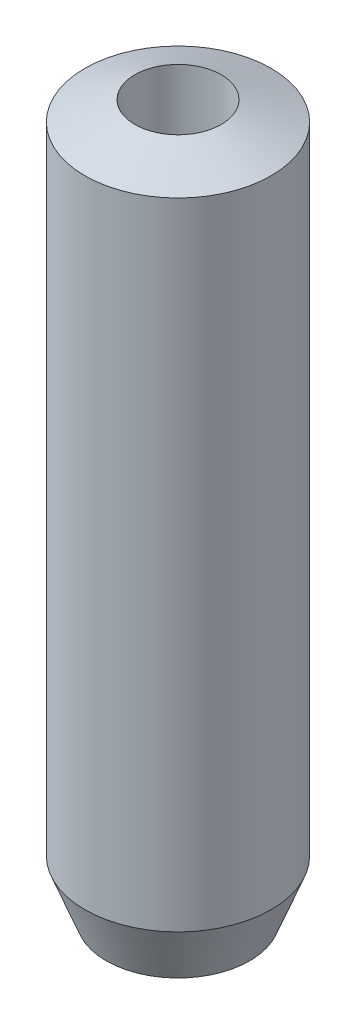
ISO-10303-21;
HEADER;
FILE_DESCRIPTION(('STEP AP214'),'2;1');
FILE_NAME('part.step','',(''),(''),'','','');
FILE_SCHEMA(('AUTOMOTIVE_DESIGN { 1 0 10303 214 1 1 1 1 }'));
ENDSEC;
DATA;
#1=APPLICATION_CONTEXT('core data for automotive mechanical design processes');
#2=APPLICATION_PROTOCOL_DEFINITION('international standard','automotive_design',2000,#1);
#3=PRODUCT_CONTEXT('',#1,'mechanical');
#4=PRODUCT('Part','Part','',(#3));
#5=PRODUCT_RELATED_PRODUCT_CATEGORY('part','',(#4));
#6=PRODUCT_DEFINITION_FORMATION('','',#4);
#7=PRODUCT_DEFINITION_CONTEXT('part definition',#1,'design');
#8=PRODUCT_DEFINITION('design','',#6,#7);
#9=PRODUCT_DEFINITION_SHAPE('','',#8);
#10=(LENGTH_UNIT() NAMED_UNIT(*) SI_UNIT(.MILLI.,.METRE.));
#11=(NAMED_UNIT(*) PLANE_ANGLE_UNIT() SI_UNIT($,.RADIAN.));
#12=(NAMED_UNIT(*) SI_UNIT($,.STERADIAN.) SOLID_ANGLE_UNIT());
#13=UNCERTAINTY_MEASURE_WITH_UNIT(LENGTH_MEASURE(1.E-05),#10,'distance_accuracy_value','');
#14=(GEOMETRIC_REPRESENTATION_CONTEXT(3) GLOBAL_UNCERTAINTY_ASSIGNED_CONTEXT((#13)) GLOBAL_UNIT_ASSIGNED_CONTEXT((#10,
#11,#12)) REPRESENTATION_CONTEXT('',''));
#15=CARTESIAN_POINT('',(0.,0.,0.));
#16=DIRECTION('',(0.,0.,1.));
#17=DIRECTION('',(1.,0.,0.));
#18=AXIS2_PLACEMENT_3D('',#15,#16,#17);
#19=CARTESIAN_POINT('',(0.,57.354290539753,0.));
#20=DIRECTION('',(0.,-1.,0.));
#21=DIRECTION('',(0.,0.,-1.));
#22=AXIS2_PLACEMENT_3D('',#19,#20,#21);
#23=CYLINDRICAL_SURFACE('',#22,7.5);
#24=CARTESIAN_POINT('',(0.,55.6315644722749,0.));
#25=DIRECTION('',(0.,1.,0.));
#26=DIRECTION('',(0.,0.,1.));
#27=AXIS2_PLACEMENT_3D('',#24,#25,#26);
#28=CIRCLE('',#27,7.5);
#29=CARTESIAN_POINT('',(0.,55.6315644722749,-7.5));
#30=VERTEX_POINT('',#29);
#31=EDGE_CURVE('E50',#30,#30,#28,.F.);
#32=CARTESIAN_POINT('',(0.,4.43321588185451,0.));
#33=DIRECTION('',(0.,1.,0.));
#34=DIRECTION('',(0.,0.,1.));
#35=AXIS2_PLACEMENT_3D('',#32,#33,#34);
#36=CIRCLE('',#35,7.5);
#37=CARTESIAN_POINT('',(0.,4.43321588185451,-7.5));
#38=VERTEX_POINT('',#37);
#39=EDGE_CURVE('E51',#38,#38,#36,.T.);
#40=CARTESIAN_POINT('',(0.,55.6315644722749,-7.5));
#41=CARTESIAN_POINT('',(0.,55.0982483411247,-7.5));
#42=CARTESIAN_POINT('',(0.,54.5649322099745,-7.5));
#43=CARTESIAN_POINT('',(0.,53.4982999476741,-7.5));
#44=CARTESIAN_POINT('',(0.,52.9649838165239,-7.5));
#45=CARTESIAN_POINT('',(0.,51.8983515542234,-7.5));
#46=CARTESIAN_POINT('',(0.,51.3650354230732,-7.5));
#47=CARTESIAN_POINT('',(0.,50.2984031607728,-7.5));
#48=CARTESIAN_POINT('',(0.,49.7650870296226,-7.5));
#49=CARTESIAN_POINT('',(0.,48.6984547673222,-7.5));
#50=CARTESIAN_POINT('',(0.,48.165138636172,-7.5));
#51=CARTESIAN_POINT('',(0.,47.0985063738715,-7.5));
#52=CARTESIAN_POINT('',(0.,46.5651902427213,-7.5));
#53=CARTESIAN_POINT('',(0.,45.4985579804209,-7.5));
#54=CARTESIAN_POINT('',(0.,44.9652418492707,-7.5));
#55=CARTESIAN_POINT('',(0.,43.8986095869702,-7.5));
#56=CARTESIAN_POINT('',(0.,43.36529345582,-7.5));
#57=CARTESIAN_POINT('',(0.,42.2986611935196,-7.5));
#58=CARTESIAN_POINT('',(0.,41.7653450623694,-7.5));
#59=CARTESIAN_POINT('',(0.,40.698712800069,-7.5));
#60=CARTESIAN_POINT('',(0.,40.1653966689188,-7.5));
#61=CARTESIAN_POINT('',(0.,39.0987644066183,-7.5));
#62=CARTESIAN_POINT('',(0.,38.5654482754681,-7.5));
#63=CARTESIAN_POINT('',(0.,37.4988160131677,-7.5));
#64=CARTESIAN_POINT('',(0.,36.9654998820175,-7.5));
#65=CARTESIAN_POINT('',(0.,35.8988676197171,-7.5));
#66=CARTESIAN_POINT('',(0.,35.3655514885668,-7.5));
#67=CARTESIAN_POINT('',(0.,34.2989192262664,-7.5));
#68=CARTESIAN_POINT('',(0.,33.7656030951162,-7.5));
#69=CARTESIAN_POINT('',(0.,32.6989708328158,-7.5));
#70=CARTESIAN_POINT('',(0.,32.1656547016656,-7.5));
#71=CARTESIAN_POINT('',(0.,31.0990224393651,-7.5));
#72=CARTESIAN_POINT('',(0.,30.5657063082149,-7.5));
#73=CARTESIAN_POINT('',(0.,29.4990740459145,-7.5));
#74=CARTESIAN_POINT('',(0.,28.9657579147643,-7.5));
#75=CARTESIAN_POINT('',(0.,27.8991256524639,-7.5));
#76=CARTESIAN_POINT('',(0.,27.3658095213137,-7.5));
#77=CARTESIAN_POINT('',(0.,26.2991772590132,-7.5));
#78=CARTESIAN_POINT('',(0.,25.765861127863,-7.5));
#79=CARTESIAN_POINT('',(0.,24.6992288655626,-7.5));
#80=CARTESIAN_POINT('',(0.,24.1659127344124,-7.5));
#81=CARTESIAN_POINT('',(0.,23.099280472112,-7.5));
#82=CARTESIAN_POINT('',(0.,22.5659643409617,-7.5));
#83=CARTESIAN_POINT('',(0.,21.4993320786613,-7.5));
#84=CARTESIAN_POINT('',(0.,20.9660159475111,-7.5));
#85=CARTESIAN_POINT('',(0.,19.8993836852107,-7.5));
#86=CARTESIAN_POINT('',(0.,19.3660675540605,-7.5));
#87=CARTESIAN_POINT('',(0.,18.29943529176,-7.5));
#88=CARTESIAN_POINT('',(0.,17.7661191606098,-7.5));
#89=CARTESIAN_POINT('',(0.,16.6994868983094,-7.5));
#90=CARTESIAN_POINT('',(0.,16.1661707671592,-7.5));
#91=CARTESIAN_POINT('',(0.,15.0995385048588,-7.5));
#92=CARTESIAN_POINT('',(0.,14.5662223737085,-7.5));
#93=CARTESIAN_POINT('',(0.,13.4995901114081,-7.5));
#94=CARTESIAN_POINT('',(0.,12.9662739802579,-7.5));
#95=CARTESIAN_POINT('',(0.,11.8996417179575,-7.5));
#96=CARTESIAN_POINT('',(0.,11.3663255868073,-7.5));
#97=CARTESIAN_POINT('',(0.,10.2996933245068,-7.5));
#98=CARTESIAN_POINT('',(0.,9.76637719335663,-7.5));
#99=CARTESIAN_POINT('',(0.,8.69974493105621,-7.5));
#100=CARTESIAN_POINT('',(0.,8.166428799906,-7.5));
#101=CARTESIAN_POINT('',(0.,7.09979653760557,-7.5));
#102=CARTESIAN_POINT('',(0.,6.56648040645536,-7.5));
#103=CARTESIAN_POINT('',(0.,5.49984814415494,-7.5));
#104=CARTESIAN_POINT('',(0.,4.96653201300472,-7.5));
#105=CARTESIAN_POINT('',(0.,4.43321588185451,-7.5));
#106=B_SPLINE_CURVE_WITH_KNOTS('',3,(#40,#41,#42,#43,#44,#45,#46,#47,#48,#49,#50,#51,#52,#53,
#54,#55,#56,#57,#58,#59,#60,#61,#62,#63,#64,#65,#66,#67,#68,#69,#70,#71,#72,#73,#74,#75,#76,#77,
#78,#79,#80,#81,#82,#83,#84,#85,#86,#87,#88,#89,#90,#91,#92,#93,#94,#95,#96,#97,#98,#99,#100,
#101,#102,#103,#104,#105),.UNSPECIFIED.,.F.,.F.,(4,2,2,2,2,2,2,2,2,2,2,2,2,2,2,2,2,2,2,2,2,2,2,
2,2,2,2,2,2,2,2,2,4),(0.,1.59994839345064,3.19989678690128,4.79984518035192,6.39979357380255,
7.99974196725319,9.59969036070383,11.1996387541545,12.7995871476051,14.3995355410557,
15.9994839345064,17.599432327957,19.1993807214077,20.7993291148583,22.3992775083089,
23.9992259017596,25.5991742952102,27.1991226886609,28.7990710821115,30.3990194755621,
31.9989678690128,33.5989162624634,35.198864655914,36.7988130493647,38.3987614428153,
39.998709836266,41.5986582297166,43.1986066231672,44.7985550166179,46.3985034100685,
47.9984518035191,49.5984001969698,51.1983485904204),.UNSPECIFIED.);
#107=EDGE_CURVE('BSEAM39',#30,#38,#106,.T.);
#108=ORIENTED_EDGE('',*,*,#31,.T.);
#109=ORIENTED_EDGE('',*,*,#39,.T.);
#110=ORIENTED_EDGE('',*,*,#107,.T.);
#111=ORIENTED_EDGE('',*,*,#107,.F.);
#112=EDGE_LOOP('',(#108,#110,#109,#111));
#113=FACE_BOUND('',#112,.T.);
#114=ADVANCED_FACE('F39',(#113),#23,.T.);
#115=CARTESIAN_POINT('',(0.,0.,0.));
#116=DIRECTION('',(0.,1.,0.));
#117=DIRECTION('',(0.,0.,1.));
#118=AXIS2_PLACEMENT_3D('',#115,#116,#117);
#119=PLANE('',#118);
#120=CARTESIAN_POINT('',(0.,0.,0.));
#121=DIRECTION('',(0.,1.,0.));
#122=DIRECTION('',(0.,0.,1.));
#123=AXIS2_PLACEMENT_3D('',#120,#121,#122);
#124=CIRCLE('',#123,5.77727393252186);
#125=CARTESIAN_POINT('',(0.,0.,5.77727393252186));
#126=VERTEX_POINT('',#125);
#127=EDGE_CURVE('E10',#126,#126,#124,.F.);
#128=ORIENTED_EDGE('',*,*,#127,.T.);
#129=EDGE_LOOP('',(#128));
#130=FACE_BOUND('',#129,.T.);
#131=CARTESIAN_POINT('',(0.,0.,0.));
#132=DIRECTION('',(0.,1.,0.));
#133=DIRECTION('',(0.,0.,1.));
#134=AXIS2_PLACEMENT_3D('',#131,#132,#133);
#135=CIRCLE('',#134,3.47624549766839);
#136=CARTESIAN_POINT('',(0.,0.,-3.47624549766839));
#137=VERTEX_POINT('',#136);
#138=EDGE_CURVE('E58',#137,#137,#135,.T.);
#139=ORIENTED_EDGE('',*,*,#138,.T.);
#140=EDGE_LOOP('',(#139));
#141=FACE_BOUND('',#140,.T.);
#142=ADVANCED_FACE('F62',(#130,#141),#119,.F.);
#143=CARTESIAN_POINT('',(0.,57.354290539753,0.));
#144=DIRECTION('',(0.,-1.,0.));
#145=DIRECTION('',(0.,0.,-1.));
#146=AXIS2_PLACEMENT_3D('',#143,#144,#145);
#147=CYLINDRICAL_SURFACE('',#146,3.47624549766839);
#148=CARTESIAN_POINT('',(0.,57.1951758449292,0.));
#149=DIRECTION('',(0.,-1.,0.));
#150=DIRECTION('',(0.,0.,-1.));
#151=AXIS2_PLACEMENT_3D('',#148,#149,#150);
#152=CIRCLE('',#151,3.47624549766839);
#153=CARTESIAN_POINT('',(0.,57.1951758449292,-3.47624549766839));
#154=VERTEX_POINT('',#153);
#155=EDGE_CURVE('E54',#154,#154,#152,.F.);
#156=CARTESIAN_POINT('',(0.,57.1951758449292,-3.47624549766839));
#157=CARTESIAN_POINT('',(0.,56.5993927632111,-3.47624549766839));
#158=CARTESIAN_POINT('',(0.,56.0036096814931,-3.47624549766839));
#159=CARTESIAN_POINT('',(0.,54.8120435180571,-3.47624549766839));
#160=CARTESIAN_POINT('',(0.,54.2162604363391,-3.47624549766839));
#161=CARTESIAN_POINT('',(0.,53.0246942729031,-3.47624549766839));
#162=CARTESIAN_POINT('',(0.,52.4289111911851,-3.47624549766839));
#163=CARTESIAN_POINT('',(0.,51.2373450277491,-3.47624549766839));
#164=CARTESIAN_POINT('',(0.,50.641561946031,-3.47624549766839));
#165=CARTESIAN_POINT('',(0.,49.449995782595,-3.47624549766839));
#166=CARTESIAN_POINT('',(0.,48.854212700877,-3.47624549766839));
#167=CARTESIAN_POINT('',(0.,47.662646537441,-3.47624549766839));
#168=CARTESIAN_POINT('',(0.,47.066863455723,-3.47624549766839));
#169=CARTESIAN_POINT('',(0.,45.8752972922869,-3.47624549766839));
#170=CARTESIAN_POINT('',(0.,45.2795142105689,-3.47624549766839));
#171=CARTESIAN_POINT('',(0.,44.0879480471329,-3.47624549766839));
#172=CARTESIAN_POINT('',(0.,43.4921649654149,-3.47624549766839));
#173=CARTESIAN_POINT('',(0.,42.3005988019789,-3.47624549766839));
#174=CARTESIAN_POINT('',(0.,41.7048157202609,-3.47624549766839));
#175=CARTESIAN_POINT('',(0.,40.5132495568248,-3.47624549766839));
#176=CARTESIAN_POINT('',(0.,39.9174664751068,-3.47624549766839));
#177=CARTESIAN_POINT('',(0.,38.7259003116708,-3.47624549766839));
#178=CARTESIAN_POINT('',(0.,38.1301172299528,-3.47624549766839));
#179=CARTESIAN_POINT('',(0.,36.9385510665168,-3.47624549766839));
#180=CARTESIAN_POINT('',(0.,36.3427679847987,-3.47624549766839));
#181=CARTESIAN_POINT('',(0.,35.1512018213627,-3.47624549766839));
#182=CARTESIAN_POINT('',(0.,34.5554187396447,-3.47624549766839));
#183=CARTESIAN_POINT('',(0.,33.3638525762087,-3.47624549766839));
#184=CARTESIAN_POINT('',(0.,32.7680694944907,-3.47624549766839));
#185=CARTESIAN_POINT('',(0.,31.5765033310546,-3.47624549766839));
#186=CARTESIAN_POINT('',(0.,30.9807202493366,-3.47624549766839));
#187=CARTESIAN_POINT('',(0.,29.7891540859006,-3.47624549766839));
#188=CARTESIAN_POINT('',(0.,29.1933710041826,-3.47624549766839));
#189=CARTESIAN_POINT('',(0.,28.0018048407466,-3.47624549766839));
#190=CARTESIAN_POINT('',(0.,27.4060217590286,-3.47624549766839));
#191=CARTESIAN_POINT('',(0.,26.2144555955925,-3.47624549766839));
#192=CARTESIAN_POINT('',(0.,25.6186725138745,-3.47624549766839));
#193=CARTESIAN_POINT('',(0.,24.4271063504385,-3.47624549766839));
#194=CARTESIAN_POINT('',(0.,23.8313232687205,-3.47624549766839));
#195=CARTESIAN_POINT('',(0.,22.6397571052845,-3.47624549766839));
#196=CARTESIAN_POINT('',(0.,22.0439740235665,-3.47624549766839));
#197=CARTESIAN_POINT('',(0.,20.8524078601304,-3.47624549766839));
#198=CARTESIAN_POINT('',(0.,20.2566247784124,-3.47624549766839));
#199=CARTESIAN_POINT('',(0.,19.0650586149764,-3.47624549766839));
#200=CARTESIAN_POINT('',(0.,18.4692755332584,-3.47624549766839));
#201=CARTESIAN_POINT('',(0.,17.2777093698224,-3.47624549766839));
#202=CARTESIAN_POINT('',(0.,16.6819262881043,-3.47624549766839));
#203=CARTESIAN_POINT('',(0.,15.4903601246683,-3.47624549766839));
#204=CARTESIAN_POINT('',(0.,14.8945770429503,-3.47624549766839));
#205=CARTESIAN_POINT('',(0.,13.7030108795143,-3.47624549766839));
#206=CARTESIAN_POINT('',(0.,13.1072277977963,-3.47624549766839));
#207=CARTESIAN_POINT('',(0.,11.9156616343602,-3.47624549766839));
#208=CARTESIAN_POINT('',(0.,11.3198785526422,-3.47624549766839));
#209=CARTESIAN_POINT('',(0.,10.1283123892062,-3.47624549766839));
#210=CARTESIAN_POINT('',(0.,9.5325293074882,-3.47624549766839));
#211=CARTESIAN_POINT('',(0.,8.34096314405217,-3.47624549766839));
#212=CARTESIAN_POINT('',(0.,7.74518006233416,-3.47624549766839));
#213=CARTESIAN_POINT('',(0.,6.55361389889813,-3.47624549766839));
#214=CARTESIAN_POINT('',(0.,5.95783081718012,-3.47624549766839));
#215=CARTESIAN_POINT('',(0.,4.7662646537441,-3.47624549766839));
#216=CARTESIAN_POINT('',(0.,4.17048157202609,-3.47624549766839));
#217=CARTESIAN_POINT('',(0.,2.97891540859006,-3.47624549766839));
#218=CARTESIAN_POINT('',(0.,2.38313232687205,-3.47624549766839));
#219=CARTESIAN_POINT('',(0.,1.19156616343602,-3.47624549766839));
#220=CARTESIAN_POINT('',(0.,0.595783081718012,-3.47624549766839));
#221=CARTESIAN_POINT('',(0.,0.,-3.47624549766839));
#222=B_SPLINE_CURVE_WITH_KNOTS('',3,(#156,#157,#158,#159,#160,#161,#162,#163,#164,#165,#166,
#167,#168,#169,#170,#171,#172,#173,#174,#175,#176,#177,#178,#179,#180,#181,#182,#183,#184,#185,
#186,#187,#188,#189,#190,#191,#192,#193,#194,#195,#196,#197,#198,#199,#200,#201,#202,#203,#204,
#205,#206,#207,#208,#209,#210,#211,#212,#213,#214,#215,#216,#217,#218,#219,#220,#221),
.UNSPECIFIED.,.F.,.F.,(4,2,2,2,2,2,2,2,2,2,2,2,2,2,2,2,2,2,2,2,2,2,2,2,2,2,2,2,2,2,2,2,4),(0.,
1.78734924515403,3.57469849030807,5.3620477354621,7.14939698061614,8.93674622577018,
10.7240954709242,12.5114447160782,14.2987939612323,16.0861432063863,17.8734924515404,
19.6608416966944,21.4481909418484,23.2355401870025,25.0228894321565,26.8102386773105,
28.5975879224646,30.3849371676186,32.1722864127726,33.9596356579267,35.7469849030807,
37.5343341482348,39.3216833933888,41.1090326385428,42.8963818836969,44.6837311288509,
46.4710803740049,48.258429619159,50.045778864313,51.8331281094671,53.6204773546211,
55.4078265997751,57.1951758449292),.UNSPECIFIED.);
#223=EDGE_CURVE('BSEAM68',#154,#137,#222,.T.);
#224=ORIENTED_EDGE('',*,*,#155,.T.);
#225=ORIENTED_EDGE('',*,*,#138,.F.);
#226=ORIENTED_EDGE('',*,*,#223,.T.);
#227=ORIENTED_EDGE('',*,*,#223,.F.);
#228=EDGE_LOOP('',(#224,#226,#225,#227));
#229=FACE_BOUND('',#228,.T.);
#230=ADVANCED_FACE('F68',(#229),#147,.F.);
#231=CARTESIAN_POINT('',(0.,57.354290539753,0.));
#232=DIRECTION('',(0.,-1.,0.));
#233=DIRECTION('',(0.,0.,-1.));
#234=AXIS2_PLACEMENT_3D('',#231,#232,#233);
#235=CONICAL_SURFACE('',#234,3.06678411814555,1.20016023863047);
#236=ORIENTED_EDGE('',*,*,#31,.F.);
#237=EDGE_LOOP('',(#236));
#238=FACE_BOUND('',#237,.T.);
#239=ORIENTED_EDGE('',*,*,#155,.F.);
#240=EDGE_LOOP('',(#239));
#241=FACE_BOUND('',#240,.T.);
#242=ADVANCED_FACE('F66',(#238,#241),#235,.T.);
#243=CARTESIAN_POINT('',(0.,4.43321588185451,0.));
#244=DIRECTION('',(0.,1.,0.));
#245=DIRECTION('',(0.,0.,1.));
#246=AXIS2_PLACEMENT_3D('',#243,#244,#245);
#247=CONICAL_SURFACE('',#246,7.5,0.370636088164433);
#248=ORIENTED_EDGE('',*,*,#127,.F.);
#249=EDGE_LOOP('',(#248));
#250=FACE_BOUND('',#249,.T.);
#251=ORIENTED_EDGE('',*,*,#39,.F.);
#252=EDGE_LOOP('',(#251));
#253=FACE_BOUND('',#252,.T.);
#254=ADVANCED_FACE('F45',(#250,#253),#247,.T.);
#255=CLOSED_SHELL('',(#114,#142,#230,#242,#254));
#256=MANIFOLD_SOLID_BREP('B2',#255);
#257=ADVANCED_BREP_SHAPE_REPRESENTATION('',(#18,#256),#14);
#258=SHAPE_DEFINITION_REPRESENTATION(#9,#257);
ENDSEC;
END-ISO-10303-21;
